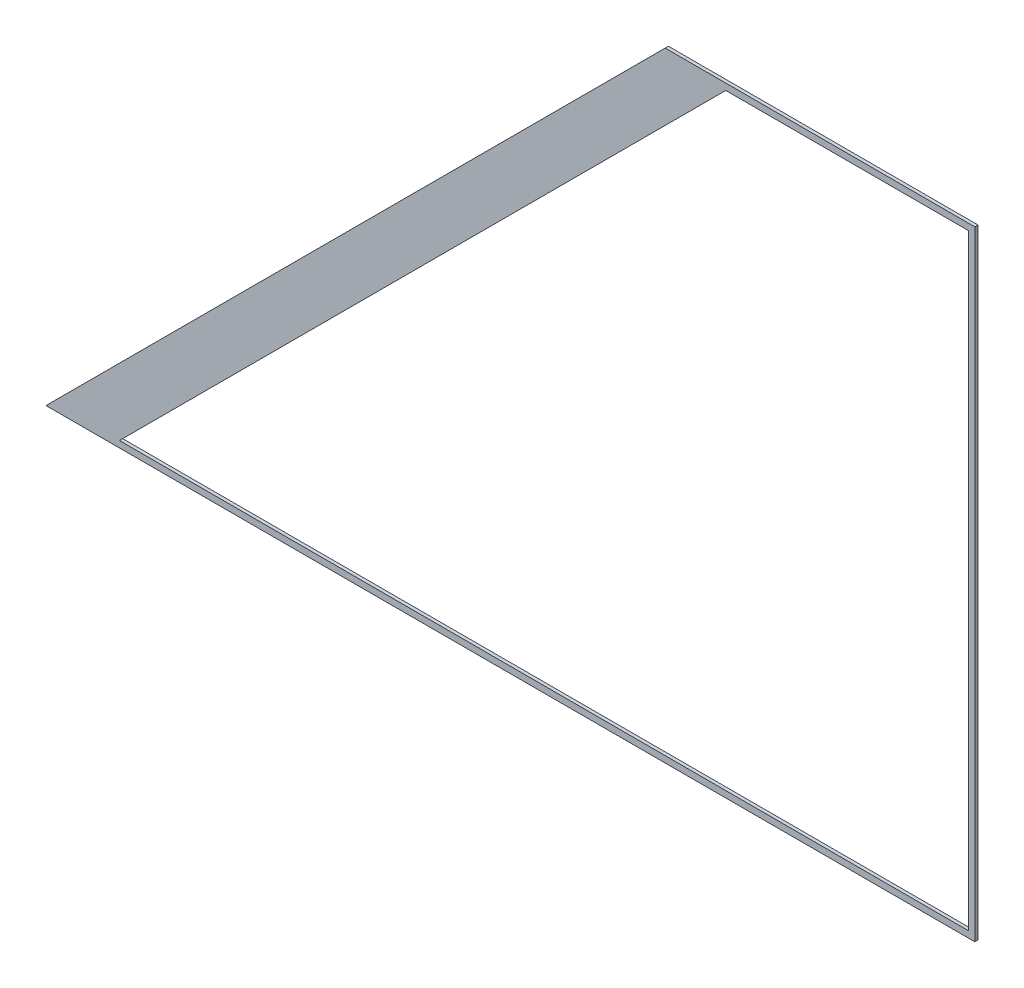
ISO-10303-21;
HEADER;
FILE_DESCRIPTION(('STEP AP214'),'2;1');
FILE_NAME('part.step','',(''),(''),'','','');
FILE_SCHEMA(('AUTOMOTIVE_DESIGN { 1 0 10303 214 1 1 1 1 }'));
ENDSEC;
DATA;
#1=APPLICATION_CONTEXT('core data for automotive mechanical design processes');
#2=APPLICATION_PROTOCOL_DEFINITION('international standard','automotive_design',2000,#1);
#3=PRODUCT_CONTEXT('',#1,'mechanical');
#4=PRODUCT('Part','Part','',(#3));
#5=PRODUCT_RELATED_PRODUCT_CATEGORY('part','',(#4));
#6=PRODUCT_DEFINITION_FORMATION('','',#4);
#7=PRODUCT_DEFINITION_CONTEXT('part definition',#1,'design');
#8=PRODUCT_DEFINITION('design','',#6,#7);
#9=PRODUCT_DEFINITION_SHAPE('','',#8);
#10=(LENGTH_UNIT() NAMED_UNIT(*) SI_UNIT(.MILLI.,.METRE.));
#11=(NAMED_UNIT(*) PLANE_ANGLE_UNIT() SI_UNIT($,.RADIAN.));
#12=(NAMED_UNIT(*) SI_UNIT($,.STERADIAN.) SOLID_ANGLE_UNIT());
#13=UNCERTAINTY_MEASURE_WITH_UNIT(LENGTH_MEASURE(1.E-05),#10,'distance_accuracy_value','');
#14=(GEOMETRIC_REPRESENTATION_CONTEXT(3) GLOBAL_UNCERTAINTY_ASSIGNED_CONTEXT((#13)) GLOBAL_UNIT_ASSIGNED_CONTEXT((#10,
#11,#12)) REPRESENTATION_CONTEXT('',''));
#15=CARTESIAN_POINT('',(0.,0.,0.));
#16=DIRECTION('',(0.,0.,1.));
#17=DIRECTION('',(1.,0.,0.));
#18=AXIS2_PLACEMENT_3D('',#15,#16,#17);
#19=CARTESIAN_POINT('',(609.600000000007,609.6,3.175));
#20=DIRECTION('',(0.707106781186544,-0.707106781186551,0.));
#21=DIRECTION('',(0.707106781186551,0.707106781186544,0.));
#22=AXIS2_PLACEMENT_3D('',#19,#20,#21);
#23=PLANE('',#22);
#24=DIRECTION('',(-0.707106781186551,-0.707106781186544,0.));
#25=VECTOR('',#24,1.);
#26=CARTESIAN_POINT('',(609.600000000007,609.6,0.));
#27=LINE('',#26,#25);
#28=CARTESIAN_POINT('',(609.600000000007,609.6,0.));
#29=VERTEX_POINT('',#28);
#30=CARTESIAN_POINT('',(0.,0.,0.));
#31=VERTEX_POINT('',#30);
#32=EDGE_CURVE('E130',#29,#31,#27,.T.);
#33=ORIENTED_EDGE('',*,*,#32,.T.);
#34=DIRECTION('',(0.,0.,-1.));
#35=VECTOR('',#34,1.);
#36=CARTESIAN_POINT('',(0.,0.,3.175));
#37=LINE('',#36,#35);
#38=CARTESIAN_POINT('',(0.,0.,3.175));
#39=VERTEX_POINT('',#38);
#40=EDGE_CURVE('E11',#39,#31,#37,.T.);
#41=ORIENTED_EDGE('',*,*,#40,.F.);
#42=DIRECTION('',(-0.707106781186551,-0.707106781186544,0.));
#43=VECTOR('',#42,1.);
#44=CARTESIAN_POINT('',(609.600000000007,609.6,3.175));
#45=LINE('',#44,#43);
#46=CARTESIAN_POINT('',(609.600000000007,609.6,3.175));
#47=VERTEX_POINT('',#46);
#48=EDGE_CURVE('E134',#47,#39,#45,.T.);
#49=ORIENTED_EDGE('',*,*,#48,.F.);
#50=DIRECTION('',(0.,0.,-1.));
#51=VECTOR('',#50,1.);
#52=CARTESIAN_POINT('',(609.600000000007,609.6,3.175));
#53=LINE('',#52,#51);
#54=EDGE_CURVE('E144',#47,#29,#53,.T.);
#55=ORIENTED_EDGE('',*,*,#54,.T.);
#56=EDGE_LOOP('',(#33,#41,#49,#55));
#57=FACE_BOUND('',#56,.T.);
#58=ADVANCED_FACE('F33',(#57),#23,.F.);
#59=CARTESIAN_POINT('',(0.,0.,3.175));
#60=DIRECTION('',(0.,1.,0.));
#61=DIRECTION('',(0.,0.,1.));
#62=AXIS2_PLACEMENT_3D('',#59,#60,#61);
#63=PLANE('',#62);
#64=DIRECTION('',(1.,0.,0.));
#65=VECTOR('',#64,1.);
#66=CARTESIAN_POINT('',(0.,0.,0.));
#67=LINE('',#66,#65);
#68=CARTESIAN_POINT('',(914.4,0.,0.));
#69=VERTEX_POINT('',#68);
#70=EDGE_CURVE('E147',#31,#69,#67,.T.);
#71=ORIENTED_EDGE('',*,*,#70,.T.);
#72=DIRECTION('',(0.,0.,-1.));
#73=VECTOR('',#72,1.);
#74=CARTESIAN_POINT('',(914.4,0.,3.175));
#75=LINE('',#74,#73);
#76=CARTESIAN_POINT('',(914.4,0.,3.175));
#77=VERTEX_POINT('',#76);
#78=EDGE_CURVE('E40',#77,#69,#75,.T.);
#79=ORIENTED_EDGE('',*,*,#78,.F.);
#80=DIRECTION('',(1.,0.,0.));
#81=VECTOR('',#80,1.);
#82=CARTESIAN_POINT('',(0.,0.,3.175));
#83=LINE('',#82,#81);
#84=EDGE_CURVE('E137',#39,#77,#83,.T.);
#85=ORIENTED_EDGE('',*,*,#84,.F.);
#86=ORIENTED_EDGE('',*,*,#40,.T.);
#87=EDGE_LOOP('',(#71,#79,#85,#86));
#88=FACE_BOUND('',#87,.T.);
#89=ADVANCED_FACE('F175',(#88),#63,.F.);
#90=CARTESIAN_POINT('',(914.4,0.,3.175));
#91=DIRECTION('',(-1.,0.,0.));
#92=DIRECTION('',(0.,0.,1.));
#93=AXIS2_PLACEMENT_3D('',#90,#91,#92);
#94=PLANE('',#93);
#95=DIRECTION('',(0.,1.,0.));
#96=VECTOR('',#95,1.);
#97=CARTESIAN_POINT('',(914.4,0.,0.));
#98=LINE('',#97,#96);
#99=CARTESIAN_POINT('',(914.4,609.6,0.));
#100=VERTEX_POINT('',#99);
#101=EDGE_CURVE('E149',#69,#100,#98,.T.);
#102=ORIENTED_EDGE('',*,*,#101,.T.);
#103=DIRECTION('',(0.,0.,-1.));
#104=VECTOR('',#103,1.);
#105=CARTESIAN_POINT('',(914.4,609.6,3.175));
#106=LINE('',#105,#104);
#107=CARTESIAN_POINT('',(914.4,609.6,3.175));
#108=VERTEX_POINT('',#107);
#109=EDGE_CURVE('E154',#108,#100,#106,.T.);
#110=ORIENTED_EDGE('',*,*,#109,.F.);
#111=DIRECTION('',(0.,1.,0.));
#112=VECTOR('',#111,1.);
#113=CARTESIAN_POINT('',(914.4,0.,3.175));
#114=LINE('',#113,#112);
#115=EDGE_CURVE('E140',#77,#108,#114,.T.);
#116=ORIENTED_EDGE('',*,*,#115,.F.);
#117=ORIENTED_EDGE('',*,*,#78,.T.);
#118=EDGE_LOOP('',(#102,#110,#116,#117));
#119=FACE_BOUND('',#118,.T.);
#120=ADVANCED_FACE('F161',(#119),#94,.F.);
#121=CARTESIAN_POINT('',(914.4,609.6,3.175));
#122=DIRECTION('',(0.,-1.,0.));
#123=DIRECTION('',(0.,0.,-1.));
#124=AXIS2_PLACEMENT_3D('',#121,#122,#123);
#125=PLANE('',#124);
#126=DIRECTION('',(-1.,0.,0.));
#127=VECTOR('',#126,1.);
#128=CARTESIAN_POINT('',(914.4,609.6,0.));
#129=LINE('',#128,#127);
#130=EDGE_CURVE('E138',#100,#29,#129,.T.);
#131=ORIENTED_EDGE('',*,*,#130,.T.);
#132=ORIENTED_EDGE('',*,*,#54,.F.);
#133=DIRECTION('',(-1.,0.,0.));
#134=VECTOR('',#133,1.);
#135=CARTESIAN_POINT('',(914.4,609.6,3.175));
#136=LINE('',#135,#134);
#137=EDGE_CURVE('E142',#108,#47,#136,.T.);
#138=ORIENTED_EDGE('',*,*,#137,.F.);
#139=ORIENTED_EDGE('',*,*,#109,.T.);
#140=EDGE_LOOP('',(#131,#132,#138,#139));
#141=FACE_BOUND('',#140,.T.);
#142=ADVANCED_FACE('F168',(#141),#125,.F.);
#143=CARTESIAN_POINT('',(0.,0.,3.175));
#144=DIRECTION('',(0.,0.,1.));
#145=DIRECTION('',(1.,0.,0.));
#146=AXIS2_PLACEMENT_3D('',#143,#144,#145);
#147=PLANE('',#146);
#148=DIRECTION('',(-0.707106781186551,-0.707106781186544,0.));
#149=VECTOR('',#148,1.);
#150=CARTESIAN_POINT('',(669.209153243355,603.25,3.175));
#151=LINE('',#150,#149);
#152=CARTESIAN_POINT('',(669.209153243355,603.25,3.175));
#153=VERTEX_POINT('',#152);
#154=CARTESIAN_POINT('',(72.3091532433484,6.35,3.175));
#155=VERTEX_POINT('',#154);
#156=EDGE_CURVE('E47',#153,#155,#151,.T.);
#157=ORIENTED_EDGE('',*,*,#156,.F.);
#158=DIRECTION('',(-1.,0.,0.));
#159=VECTOR('',#158,1.);
#160=CARTESIAN_POINT('',(908.05,603.25,3.175));
#161=LINE('',#160,#159);
#162=CARTESIAN_POINT('',(908.05,603.25,3.175));
#163=VERTEX_POINT('',#162);
#164=EDGE_CURVE('E115',#163,#153,#161,.T.);
#165=ORIENTED_EDGE('',*,*,#164,.F.);
#166=DIRECTION('',(0.,1.,0.));
#167=VECTOR('',#166,1.);
#168=CARTESIAN_POINT('',(908.05,6.35,3.175));
#169=LINE('',#168,#167);
#170=CARTESIAN_POINT('',(908.05,6.35,3.175));
#171=VERTEX_POINT('',#170);
#172=EDGE_CURVE('E118',#171,#163,#169,.T.);
#173=ORIENTED_EDGE('',*,*,#172,.F.);
#174=DIRECTION('',(1.,0.,0.));
#175=VECTOR('',#174,1.);
#176=CARTESIAN_POINT('',(72.3091532433484,6.35,3.175));
#177=LINE('',#176,#175);
#178=EDGE_CURVE('E124',#155,#171,#177,.T.);
#179=ORIENTED_EDGE('',*,*,#178,.F.);
#180=EDGE_LOOP('',(#157,#165,#173,#179));
#181=FACE_BOUND('',#180,.T.);
#182=ORIENTED_EDGE('',*,*,#48,.T.);
#183=ORIENTED_EDGE('',*,*,#84,.T.);
#184=ORIENTED_EDGE('',*,*,#115,.T.);
#185=ORIENTED_EDGE('',*,*,#137,.T.);
#186=EDGE_LOOP('',(#182,#183,#184,#185));
#187=FACE_BOUND('',#186,.T.);
#188=ADVANCED_FACE('F174',(#181,#187),#147,.T.);
#189=CARTESIAN_POINT('',(0.,0.,0.));
#190=DIRECTION('',(0.,0.,1.));
#191=DIRECTION('',(1.,0.,0.));
#192=AXIS2_PLACEMENT_3D('',#189,#190,#191);
#193=PLANE('',#192);
#194=DIRECTION('',(-1.,0.,0.));
#195=VECTOR('',#194,1.);
#196=CARTESIAN_POINT('',(908.05,603.25,0.));
#197=LINE('',#196,#195);
#198=CARTESIAN_POINT('',(908.05,603.25,0.));
#199=VERTEX_POINT('',#198);
#200=CARTESIAN_POINT('',(669.209153243355,603.25,0.));
#201=VERTEX_POINT('',#200);
#202=EDGE_CURVE('E105',#199,#201,#197,.T.);
#203=ORIENTED_EDGE('',*,*,#202,.T.);
#204=DIRECTION('',(-0.707106781186551,-0.707106781186544,0.));
#205=VECTOR('',#204,1.);
#206=CARTESIAN_POINT('',(669.209153243355,603.25,0.));
#207=LINE('',#206,#205);
#208=CARTESIAN_POINT('',(72.3091532433484,6.35,0.));
#209=VERTEX_POINT('',#208);
#210=EDGE_CURVE('E99',#201,#209,#207,.T.);
#211=ORIENTED_EDGE('',*,*,#210,.T.);
#212=DIRECTION('',(1.,0.,0.));
#213=VECTOR('',#212,1.);
#214=CARTESIAN_POINT('',(72.3091532433484,6.35,0.));
#215=LINE('',#214,#213);
#216=CARTESIAN_POINT('',(908.05,6.35,0.));
#217=VERTEX_POINT('',#216);
#218=EDGE_CURVE('E108',#209,#217,#215,.T.);
#219=ORIENTED_EDGE('',*,*,#218,.T.);
#220=DIRECTION('',(0.,1.,0.));
#221=VECTOR('',#220,1.);
#222=CARTESIAN_POINT('',(908.05,6.35,0.));
#223=LINE('',#222,#221);
#224=EDGE_CURVE('E55',#217,#199,#223,.T.);
#225=ORIENTED_EDGE('',*,*,#224,.T.);
#226=EDGE_LOOP('',(#203,#211,#219,#225));
#227=FACE_BOUND('',#226,.T.);
#228=ORIENTED_EDGE('',*,*,#32,.F.);
#229=ORIENTED_EDGE('',*,*,#130,.F.);
#230=ORIENTED_EDGE('',*,*,#101,.F.);
#231=ORIENTED_EDGE('',*,*,#70,.F.);
#232=EDGE_LOOP('',(#228,#229,#230,#231));
#233=FACE_BOUND('',#232,.T.);
#234=ADVANCED_FACE('F112',(#227,#233),#193,.F.);
#235=CARTESIAN_POINT('',(669.209153243355,603.25,0.));
#236=DIRECTION('',(-0.707106781186544,0.707106781186551,0.));
#237=DIRECTION('',(-0.707106781186551,-0.707106781186544,0.));
#238=AXIS2_PLACEMENT_3D('',#235,#236,#237);
#239=PLANE('',#238);
#240=ORIENTED_EDGE('',*,*,#156,.T.);
#241=DIRECTION('',(0.,0.,1.));
#242=VECTOR('',#241,1.);
#243=CARTESIAN_POINT('',(72.3091532433484,6.35,0.));
#244=LINE('',#243,#242);
#245=EDGE_CURVE('E95',#209,#155,#244,.T.);
#246=ORIENTED_EDGE('',*,*,#245,.F.);
#247=ORIENTED_EDGE('',*,*,#210,.F.);
#248=DIRECTION('',(0.,0.,1.));
#249=VECTOR('',#248,1.);
#250=CARTESIAN_POINT('',(669.209153243355,603.25,0.));
#251=LINE('',#250,#249);
#252=EDGE_CURVE('E128',#201,#153,#251,.T.);
#253=ORIENTED_EDGE('',*,*,#252,.T.);
#254=EDGE_LOOP('',(#240,#246,#247,#253));
#255=FACE_BOUND('',#254,.T.);
#256=ADVANCED_FACE('F97',(#255),#239,.F.);
#257=CARTESIAN_POINT('',(908.05,603.25,0.));
#258=DIRECTION('',(0.,1.,0.));
#259=DIRECTION('',(0.,0.,1.));
#260=AXIS2_PLACEMENT_3D('',#257,#258,#259);
#261=PLANE('',#260);
#262=ORIENTED_EDGE('',*,*,#164,.T.);
#263=ORIENTED_EDGE('',*,*,#252,.F.);
#264=ORIENTED_EDGE('',*,*,#202,.F.);
#265=DIRECTION('',(0.,0.,1.));
#266=VECTOR('',#265,1.);
#267=CARTESIAN_POINT('',(908.05,603.25,0.));
#268=LINE('',#267,#266);
#269=EDGE_CURVE('E131',#199,#163,#268,.T.);
#270=ORIENTED_EDGE('',*,*,#269,.T.);
#271=EDGE_LOOP('',(#262,#263,#264,#270));
#272=FACE_BOUND('',#271,.T.);
#273=ADVANCED_FACE('F192',(#272),#261,.F.);
#274=CARTESIAN_POINT('',(908.05,6.35,0.));
#275=DIRECTION('',(1.,0.,0.));
#276=DIRECTION('',(0.,0.,-1.));
#277=AXIS2_PLACEMENT_3D('',#274,#275,#276);
#278=PLANE('',#277);
#279=ORIENTED_EDGE('',*,*,#172,.T.);
#280=ORIENTED_EDGE('',*,*,#269,.F.);
#281=ORIENTED_EDGE('',*,*,#224,.F.);
#282=DIRECTION('',(0.,0.,1.));
#283=VECTOR('',#282,1.);
#284=CARTESIAN_POINT('',(908.05,6.35,0.));
#285=LINE('',#284,#283);
#286=EDGE_CURVE('E104',#217,#171,#285,.T.);
#287=ORIENTED_EDGE('',*,*,#286,.T.);
#288=EDGE_LOOP('',(#279,#280,#281,#287));
#289=FACE_BOUND('',#288,.T.);
#290=ADVANCED_FACE('F195',(#289),#278,.F.);
#291=CARTESIAN_POINT('',(72.3091532433484,6.35,0.));
#292=DIRECTION('',(0.,-1.,0.));
#293=DIRECTION('',(1.,0.,0.));
#294=AXIS2_PLACEMENT_3D('',#291,#292,#293);
#295=PLANE('',#294);
#296=ORIENTED_EDGE('',*,*,#178,.T.);
#297=ORIENTED_EDGE('',*,*,#286,.F.);
#298=ORIENTED_EDGE('',*,*,#218,.F.);
#299=ORIENTED_EDGE('',*,*,#245,.T.);
#300=EDGE_LOOP('',(#296,#297,#298,#299));
#301=FACE_BOUND('',#300,.T.);
#302=ADVANCED_FACE('F109',(#301),#295,.F.);
#303=CLOSED_SHELL('',(#58,#89,#120,#142,#188,#234,#256,#273,#290,#302));
#304=MANIFOLD_SOLID_BREP('B2',#303);
#305=ADVANCED_BREP_SHAPE_REPRESENTATION('',(#18,#304),#14);
#306=SHAPE_DEFINITION_REPRESENTATION(#9,#305);
ENDSEC;
END-ISO-10303-21;
